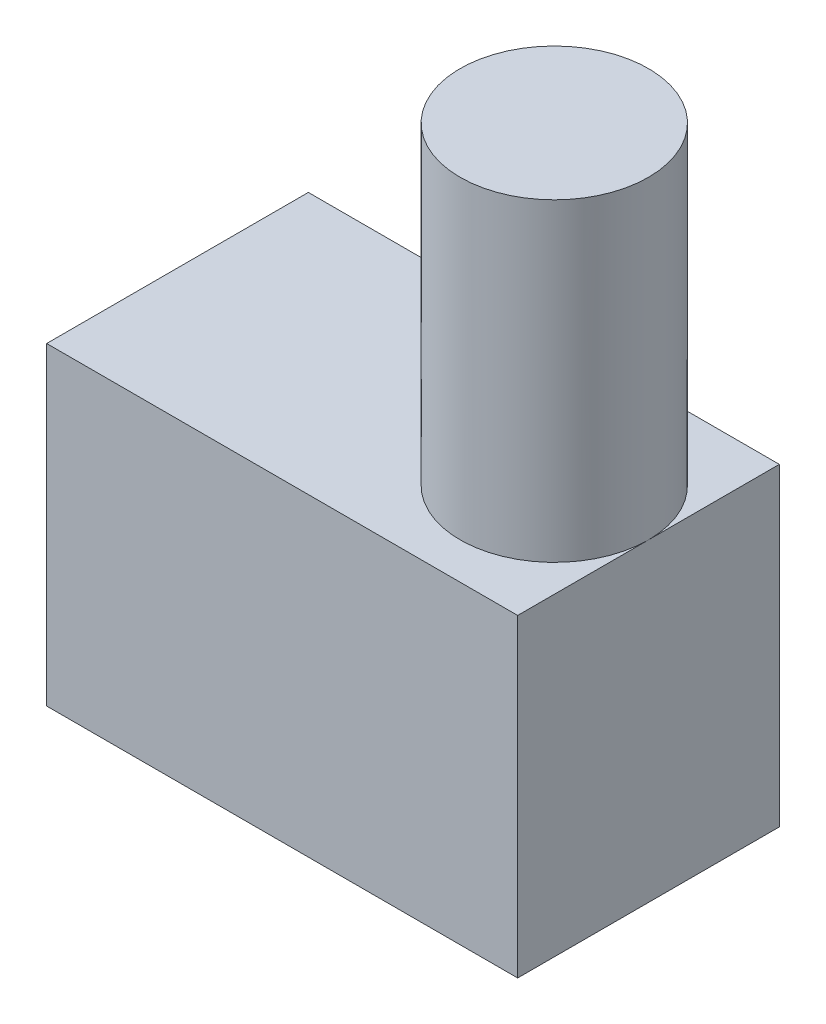
ISO-10303-21;
HEADER;
FILE_DESCRIPTION(('STEP AP214'),'2;1');
FILE_NAME('part.step','',(''),(''),'','','');
FILE_SCHEMA(('AUTOMOTIVE_DESIGN { 1 0 10303 214 1 1 1 1 }'));
ENDSEC;
DATA;
#1=APPLICATION_CONTEXT('core data for automotive mechanical design processes');
#2=APPLICATION_PROTOCOL_DEFINITION('international standard','automotive_design',2000,#1);
#3=PRODUCT_CONTEXT('',#1,'mechanical');
#4=PRODUCT('Part','Part','',(#3));
#5=PRODUCT_RELATED_PRODUCT_CATEGORY('part','',(#4));
#6=PRODUCT_DEFINITION_FORMATION('','',#4);
#7=PRODUCT_DEFINITION_CONTEXT('part definition',#1,'design');
#8=PRODUCT_DEFINITION('design','',#6,#7);
#9=PRODUCT_DEFINITION_SHAPE('','',#8);
#10=(LENGTH_UNIT() NAMED_UNIT(*) SI_UNIT(.MILLI.,.METRE.));
#11=(NAMED_UNIT(*) PLANE_ANGLE_UNIT() SI_UNIT($,.RADIAN.));
#12=(NAMED_UNIT(*) SI_UNIT($,.STERADIAN.) SOLID_ANGLE_UNIT());
#13=UNCERTAINTY_MEASURE_WITH_UNIT(LENGTH_MEASURE(1.E-05),#10,'distance_accuracy_value','');
#14=(GEOMETRIC_REPRESENTATION_CONTEXT(3) GLOBAL_UNCERTAINTY_ASSIGNED_CONTEXT((#13)) GLOBAL_UNIT_ASSIGNED_CONTEXT((#10,
#11,#12)) REPRESENTATION_CONTEXT('',''));
#15=CARTESIAN_POINT('',(0.,0.,0.));
#16=DIRECTION('',(0.,0.,1.));
#17=DIRECTION('',(1.,0.,0.));
#18=AXIS2_PLACEMENT_3D('',#15,#16,#17);
#19=CARTESIAN_POINT('',(22.5,15.,25.));
#20=DIRECTION('',(-1.,0.,0.));
#21=DIRECTION('',(0.,-1.,0.));
#22=AXIS2_PLACEMENT_3D('',#19,#20,#21);
#23=PLANE('',#22);
#24=DIRECTION('',(0.,1.,0.));
#25=VECTOR('',#24,1.);
#26=CARTESIAN_POINT('',(22.5,15.,0.));
#27=LINE('',#26,#25);
#28=CARTESIAN_POINT('',(22.5,-15.,0.));
#29=VERTEX_POINT('',#28);
#30=CARTESIAN_POINT('',(22.5,15.,0.));
#31=VERTEX_POINT('',#30);
#32=EDGE_CURVE('E92',#29,#31,#27,.T.);
#33=ORIENTED_EDGE('',*,*,#32,.T.);
#34=DIRECTION('',(0.,0.,-1.));
#35=VECTOR('',#34,1.);
#36=CARTESIAN_POINT('',(22.5,15.,25.));
#37=LINE('',#36,#35);
#38=CARTESIAN_POINT('',(22.5,15.,12.5));
#39=VERTEX_POINT('',#38);
#40=EDGE_CURVE('E41',#39,#31,#37,.T.);
#41=ORIENTED_EDGE('',*,*,#40,.F.);
#42=CARTESIAN_POINT('',(22.5,15.,25.));
#43=VERTEX_POINT('',#42);
#44=EDGE_CURVE('E11',#43,#39,#37,.T.);
#45=ORIENTED_EDGE('',*,*,#44,.F.);
#46=DIRECTION('',(0.,1.,0.));
#47=VECTOR('',#46,1.);
#48=CARTESIAN_POINT('',(22.5,15.,25.));
#49=LINE('',#48,#47);
#50=CARTESIAN_POINT('',(22.5,-15.,25.));
#51=VERTEX_POINT('',#50);
#52=EDGE_CURVE('E102',#51,#43,#49,.T.);
#53=ORIENTED_EDGE('',*,*,#52,.F.);
#54=DIRECTION('',(0.,0.,-1.));
#55=VECTOR('',#54,1.);
#56=CARTESIAN_POINT('',(22.5,-15.,25.));
#57=LINE('',#56,#55);
#58=EDGE_CURVE('E97',#51,#29,#57,.T.);
#59=ORIENTED_EDGE('',*,*,#58,.T.);
#60=EDGE_LOOP('',(#33,#41,#45,#53,#59));
#61=FACE_BOUND('',#60,.T.);
#62=ADVANCED_FACE('F33',(#61),#23,.F.);
#63=CARTESIAN_POINT('',(-22.5,15.,25.));
#64=DIRECTION('',(0.,-1.,0.));
#65=DIRECTION('',(0.,0.,-1.));
#66=AXIS2_PLACEMENT_3D('',#63,#64,#65);
#67=PLANE('',#66);
#68=ORIENTED_EDGE('',*,*,#44,.T.);
#69=CARTESIAN_POINT('',(13.5,15.,12.5));
#70=DIRECTION('',(0.,1.,0.));
#71=DIRECTION('',(0.,0.,1.));
#72=AXIS2_PLACEMENT_3D('',#69,#70,#71);
#73=CIRCLE('',#72,9.);
#74=EDGE_CURVE('E87',#39,#39,#73,.T.);
#75=ORIENTED_EDGE('',*,*,#74,.F.);
#76=ORIENTED_EDGE('',*,*,#40,.T.);
#77=DIRECTION('',(-1.,0.,0.));
#78=VECTOR('',#77,1.);
#79=CARTESIAN_POINT('',(-22.5,15.,0.));
#80=LINE('',#79,#78);
#81=CARTESIAN_POINT('',(-22.5,15.,0.));
#82=VERTEX_POINT('',#81);
#83=EDGE_CURVE('E104',#31,#82,#80,.T.);
#84=ORIENTED_EDGE('',*,*,#83,.T.);
#85=DIRECTION('',(0.,0.,-1.));
#86=VECTOR('',#85,1.);
#87=CARTESIAN_POINT('',(-22.5,15.,25.));
#88=LINE('',#87,#86);
#89=CARTESIAN_POINT('',(-22.5,15.,25.));
#90=VERTEX_POINT('',#89);
#91=EDGE_CURVE('E94',#90,#82,#88,.T.);
#92=ORIENTED_EDGE('',*,*,#91,.F.);
#93=DIRECTION('',(-1.,0.,0.));
#94=VECTOR('',#93,1.);
#95=CARTESIAN_POINT('',(-22.5,15.,25.));
#96=LINE('',#95,#94);
#97=EDGE_CURVE('E80',#43,#90,#96,.T.);
#98=ORIENTED_EDGE('',*,*,#97,.F.);
#99=EDGE_LOOP('',(#68,#75,#76,#84,#92,#98));
#100=FACE_BOUND('',#99,.T.);
#101=ADVANCED_FACE('F85',(#100),#67,.F.);
#102=CARTESIAN_POINT('',(-22.5,15.,25.));
#103=DIRECTION('',(1.,0.,0.));
#104=DIRECTION('',(0.,1.,0.));
#105=AXIS2_PLACEMENT_3D('',#102,#103,#104);
#106=PLANE('',#105);
#107=DIRECTION('',(0.,-1.,0.));
#108=VECTOR('',#107,1.);
#109=CARTESIAN_POINT('',(-22.5,15.,0.));
#110=LINE('',#109,#108);
#111=CARTESIAN_POINT('',(-22.5,-15.,0.));
#112=VERTEX_POINT('',#111);
#113=EDGE_CURVE('E67',#82,#112,#110,.T.);
#114=ORIENTED_EDGE('',*,*,#113,.T.);
#115=DIRECTION('',(0.,0.,-1.));
#116=VECTOR('',#115,1.);
#117=CARTESIAN_POINT('',(-22.5,-15.,25.));
#118=LINE('',#117,#116);
#119=CARTESIAN_POINT('',(-22.5,-15.,25.));
#120=VERTEX_POINT('',#119);
#121=EDGE_CURVE('E95',#120,#112,#118,.T.);
#122=ORIENTED_EDGE('',*,*,#121,.F.);
#123=DIRECTION('',(0.,-1.,0.));
#124=VECTOR('',#123,1.);
#125=CARTESIAN_POINT('',(-22.5,15.,25.));
#126=LINE('',#125,#124);
#127=EDGE_CURVE('E109',#90,#120,#126,.T.);
#128=ORIENTED_EDGE('',*,*,#127,.F.);
#129=ORIENTED_EDGE('',*,*,#91,.T.);
#130=EDGE_LOOP('',(#114,#122,#128,#129));
#131=FACE_BOUND('',#130,.T.);
#132=ADVANCED_FACE('F137',(#131),#106,.F.);
#133=CARTESIAN_POINT('',(-22.5,-15.,25.));
#134=DIRECTION('',(0.,1.,0.));
#135=DIRECTION('',(0.,0.,1.));
#136=AXIS2_PLACEMENT_3D('',#133,#134,#135);
#137=PLANE('',#136);
#138=DIRECTION('',(1.,0.,0.));
#139=VECTOR('',#138,1.);
#140=CARTESIAN_POINT('',(-22.5,-15.,0.));
#141=LINE('',#140,#139);
#142=EDGE_CURVE('E73',#112,#29,#141,.T.);
#143=ORIENTED_EDGE('',*,*,#142,.T.);
#144=ORIENTED_EDGE('',*,*,#58,.F.);
#145=DIRECTION('',(1.,0.,0.));
#146=VECTOR('',#145,1.);
#147=CARTESIAN_POINT('',(-22.5,-15.,25.));
#148=LINE('',#147,#146);
#149=EDGE_CURVE('E49',#120,#51,#148,.T.);
#150=ORIENTED_EDGE('',*,*,#149,.F.);
#151=ORIENTED_EDGE('',*,*,#121,.T.);
#152=EDGE_LOOP('',(#143,#144,#150,#151));
#153=FACE_BOUND('',#152,.T.);
#154=ADVANCED_FACE('F141',(#153),#137,.F.);
#155=CARTESIAN_POINT('',(0.,0.,25.));
#156=DIRECTION('',(0.,0.,1.));
#157=DIRECTION('',(1.,0.,0.));
#158=AXIS2_PLACEMENT_3D('',#155,#156,#157);
#159=PLANE('',#158);
#160=ORIENTED_EDGE('',*,*,#52,.T.);
#161=ORIENTED_EDGE('',*,*,#97,.T.);
#162=ORIENTED_EDGE('',*,*,#127,.T.);
#163=ORIENTED_EDGE('',*,*,#149,.T.);
#164=EDGE_LOOP('',(#160,#161,#162,#163));
#165=FACE_BOUND('',#164,.T.);
#166=ADVANCED_FACE('F129',(#165),#159,.T.);
#167=CARTESIAN_POINT('',(0.,0.,0.));
#168=DIRECTION('',(0.,0.,1.));
#169=DIRECTION('',(1.,0.,0.));
#170=AXIS2_PLACEMENT_3D('',#167,#168,#169);
#171=PLANE('',#170);
#172=ORIENTED_EDGE('',*,*,#32,.F.);
#173=ORIENTED_EDGE('',*,*,#142,.F.);
#174=ORIENTED_EDGE('',*,*,#113,.F.);
#175=ORIENTED_EDGE('',*,*,#83,.F.);
#176=EDGE_LOOP('',(#172,#173,#174,#175));
#177=FACE_BOUND('',#176,.T.);
#178=ADVANCED_FACE('F122',(#177),#171,.F.);
#179=CARTESIAN_POINT('',(13.5,45.,12.5));
#180=DIRECTION('',(0.,-1.,0.));
#181=DIRECTION('',(0.,0.,-1.));
#182=AXIS2_PLACEMENT_3D('',#179,#180,#181);
#183=CYLINDRICAL_SURFACE('',#182,9.);
#184=CARTESIAN_POINT('',(13.5,45.,12.5));
#185=DIRECTION('',(0.,1.,0.));
#186=DIRECTION('',(0.,0.,1.));
#187=AXIS2_PLACEMENT_3D('',#184,#185,#186);
#188=CIRCLE('',#187,9.);
#189=CARTESIAN_POINT('',(13.5,45.,21.5));
#190=VERTEX_POINT('',#189);
#191=EDGE_CURVE('E107',#190,#190,#188,.T.);
#192=ORIENTED_EDGE('',*,*,#191,.F.);
#193=EDGE_LOOP('',(#192));
#194=FACE_BOUND('',#193,.T.);
#195=ORIENTED_EDGE('',*,*,#74,.T.);
#196=EDGE_LOOP('',(#195));
#197=FACE_BOUND('',#196,.T.);
#198=ADVANCED_FACE('F119',(#194,#197),#183,.T.);
#199=CARTESIAN_POINT('',(13.5,45.,12.5));
#200=DIRECTION('',(0.,1.,0.));
#201=DIRECTION('',(0.,0.,1.));
#202=AXIS2_PLACEMENT_3D('',#199,#200,#201);
#203=PLANE('',#202);
#204=ORIENTED_EDGE('',*,*,#191,.T.);
#205=EDGE_LOOP('',(#204));
#206=FACE_BOUND('',#205,.T.);
#207=ADVANCED_FACE('F117',(#206),#203,.T.);
#208=CLOSED_SHELL('',(#62,#101,#132,#154,#166,#178,#198,#207));
#209=MANIFOLD_SOLID_BREP('B2',#208);
#210=ADVANCED_BREP_SHAPE_REPRESENTATION('',(#18,#209),#14);
#211=SHAPE_DEFINITION_REPRESENTATION(#9,#210);
ENDSEC;
END-ISO-10303-21;
